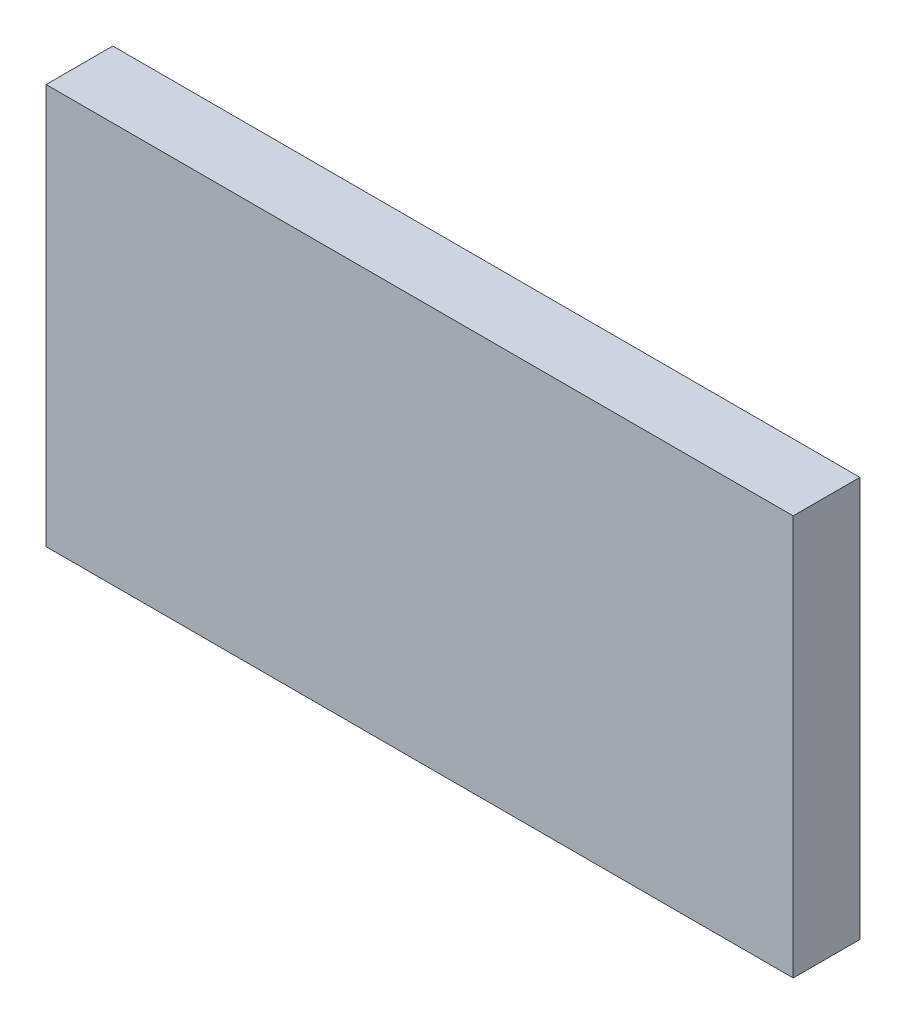
ISO-10303-21;
HEADER;
FILE_DESCRIPTION(('STEP AP214'),'2;1');
FILE_NAME('part.step','',(''),(''),'','','');
FILE_SCHEMA(('AUTOMOTIVE_DESIGN { 1 0 10303 214 1 1 1 1 }'));
ENDSEC;
DATA;
#1=APPLICATION_CONTEXT('core data for automotive mechanical design processes');
#2=APPLICATION_PROTOCOL_DEFINITION('international standard','automotive_design',2000,#1);
#3=PRODUCT_CONTEXT('',#1,'mechanical');
#4=PRODUCT('Part','Part','',(#3));
#5=PRODUCT_RELATED_PRODUCT_CATEGORY('part','',(#4));
#6=PRODUCT_DEFINITION_FORMATION('','',#4);
#7=PRODUCT_DEFINITION_CONTEXT('part definition',#1,'design');
#8=PRODUCT_DEFINITION('design','',#6,#7);
#9=PRODUCT_DEFINITION_SHAPE('','',#8);
#10=(LENGTH_UNIT() NAMED_UNIT(*) SI_UNIT(.MILLI.,.METRE.));
#11=(NAMED_UNIT(*) PLANE_ANGLE_UNIT() SI_UNIT($,.RADIAN.));
#12=(NAMED_UNIT(*) SI_UNIT($,.STERADIAN.) SOLID_ANGLE_UNIT());
#13=UNCERTAINTY_MEASURE_WITH_UNIT(LENGTH_MEASURE(1.E-05),#10,'distance_accuracy_value','');
#14=(GEOMETRIC_REPRESENTATION_CONTEXT(3) GLOBAL_UNCERTAINTY_ASSIGNED_CONTEXT((#13)) GLOBAL_UNIT_ASSIGNED_CONTEXT((#10,
#11,#12)) REPRESENTATION_CONTEXT('',''));
#15=CARTESIAN_POINT('',(0.,0.,0.));
#16=DIRECTION('',(0.,0.,1.));
#17=DIRECTION('',(1.,0.,0.));
#18=AXIS2_PLACEMENT_3D('',#15,#16,#17);
#19=CARTESIAN_POINT('',(0.864492466391478,-0.647007183565857,0.0826433070866142));
#20=DIRECTION('',(0.,0.,1.));
#21=DIRECTION('',(0.,-1.,0.));
#22=AXIS2_PLACEMENT_3D('',#19,#20,#21);
#23=PLANE('',#22);
#24=DIRECTION('',(0.,1.,0.));
#25=VECTOR('',#24,1.);
#26=CARTESIAN_POINT('',(0.790413726233998,-0.647007183565857,0.0826433070866142));
#27=LINE('',#26,#25);
#28=CARTESIAN_POINT('',(0.790413726233998,-0.64511741978633,0.0826433070866142));
#29=VERTEX_POINT('',#28);
#30=CARTESIAN_POINT('',(0.790413726233998,-0.607322144195778,0.0826433070866142));
#31=VERTEX_POINT('',#30);
#32=EDGE_CURVE('E71',#29,#31,#27,.T.);
#33=ORIENTED_EDGE('',*,*,#32,.T.);
#34=DIRECTION('',(1.,0.,0.));
#35=VECTOR('',#34,1.);
#36=CARTESIAN_POINT('',(0.864492466391478,-0.607322144195778,0.0826433070866142));
#37=LINE('',#36,#35);
#38=CARTESIAN_POINT('',(0.86096490733636,-0.607322144195778,0.0826433070866142));
#39=VERTEX_POINT('',#38);
#40=EDGE_CURVE('E54',#39,#31,#37,.F.);
#41=ORIENTED_EDGE('',*,*,#40,.F.);
#42=DIRECTION('',(0.,1.,0.));
#43=VECTOR('',#42,1.);
#44=CARTESIAN_POINT('',(0.86096490733636,-0.647007183565857,0.0826433070866142));
#45=LINE('',#44,#43);
#46=CARTESIAN_POINT('',(0.86096490733636,-0.64511741978633,0.0826433070866142));
#47=VERTEX_POINT('',#46);
#48=EDGE_CURVE('E20',#47,#39,#45,.T.);
#49=ORIENTED_EDGE('',*,*,#48,.F.);
#50=DIRECTION('',(1.,0.,0.));
#51=VECTOR('',#50,1.);
#52=CARTESIAN_POINT('',(0.78688616717888,-0.64511741978633,0.0826433070866142));
#53=LINE('',#52,#51);
#54=EDGE_CURVE('E81',#29,#47,#53,.T.);
#55=ORIENTED_EDGE('',*,*,#54,.F.);
#56=EDGE_LOOP('',(#33,#41,#49,#55));
#57=FACE_BOUND('',#56,.T.);
#58=ADVANCED_FACE('F17',(#57),#23,.F.);
#59=CARTESIAN_POINT('',(0.86096490733636,-0.647007183565857,0.0823283464566929));
#60=DIRECTION('',(-1.,0.,0.));
#61=DIRECTION('',(0.,0.,1.));
#62=AXIS2_PLACEMENT_3D('',#59,#60,#61);
#63=PLANE('',#62);
#64=DIRECTION('',(0.,0.,1.));
#65=VECTOR('',#64,1.);
#66=CARTESIAN_POINT('',(0.86096490733636,-0.64511741978633,0.0823283464566929));
#67=LINE('',#66,#65);
#68=CARTESIAN_POINT('',(0.86096490733636,-0.64511741978633,0.0889425196850394));
#69=VERTEX_POINT('',#68);
#70=EDGE_CURVE('E64',#47,#69,#67,.T.);
#71=ORIENTED_EDGE('',*,*,#70,.F.);
#72=ORIENTED_EDGE('',*,*,#48,.T.);
#73=DIRECTION('',(0.,0.,-1.));
#74=VECTOR('',#73,1.);
#75=CARTESIAN_POINT('',(0.86096490733636,-0.607322144195778,0.0823283464566929));
#76=LINE('',#75,#74);
#77=CARTESIAN_POINT('',(0.86096490733636,-0.607322144195778,0.0889425196850394));
#78=VERTEX_POINT('',#77);
#79=EDGE_CURVE('E62',#78,#39,#76,.T.);
#80=ORIENTED_EDGE('',*,*,#79,.F.);
#81=DIRECTION('',(0.,1.,0.));
#82=VECTOR('',#81,1.);
#83=CARTESIAN_POINT('',(0.86096490733636,-0.647007183565857,0.0889425196850394));
#84=LINE('',#83,#82);
#85=EDGE_CURVE('E83',#69,#78,#84,.T.);
#86=ORIENTED_EDGE('',*,*,#85,.F.);
#87=EDGE_LOOP('',(#71,#72,#80,#86));
#88=FACE_BOUND('',#87,.T.);
#89=ADVANCED_FACE('F60',(#88),#63,.F.);
#90=CARTESIAN_POINT('',(0.864492466391478,-0.607322144195778,0.0823283464566929));
#91=DIRECTION('',(0.,-1.,0.));
#92=DIRECTION('',(0.,0.,-1.));
#93=AXIS2_PLACEMENT_3D('',#90,#91,#92);
#94=PLANE('',#93);
#95=DIRECTION('',(0.,0.,1.));
#96=VECTOR('',#95,1.);
#97=CARTESIAN_POINT('',(0.790413726233998,-0.607322144195778,0.0823283464566929));
#98=LINE('',#97,#96);
#99=CARTESIAN_POINT('',(0.790413726233998,-0.607322144195778,0.0889425196850394));
#100=VERTEX_POINT('',#99);
#101=EDGE_CURVE('E73',#31,#100,#98,.T.);
#102=ORIENTED_EDGE('',*,*,#101,.T.);
#103=DIRECTION('',(1.,0.,0.));
#104=VECTOR('',#103,1.);
#105=CARTESIAN_POINT('',(0.864492466391478,-0.607322144195778,0.0889425196850394));
#106=LINE('',#105,#104);
#107=EDGE_CURVE('E69',#78,#100,#106,.F.);
#108=ORIENTED_EDGE('',*,*,#107,.F.);
#109=ORIENTED_EDGE('',*,*,#79,.T.);
#110=ORIENTED_EDGE('',*,*,#40,.T.);
#111=EDGE_LOOP('',(#102,#108,#109,#110));
#112=FACE_BOUND('',#111,.T.);
#113=ADVANCED_FACE('F68',(#112),#94,.F.);
#114=CARTESIAN_POINT('',(0.790413726233998,-0.647007183565857,0.0823283464566929));
#115=DIRECTION('',(-1.,0.,0.));
#116=DIRECTION('',(0.,0.,1.));
#117=AXIS2_PLACEMENT_3D('',#114,#115,#116);
#118=PLANE('',#117);
#119=ORIENTED_EDGE('',*,*,#32,.F.);
#120=DIRECTION('',(0.,0.,1.));
#121=VECTOR('',#120,1.);
#122=CARTESIAN_POINT('',(0.790413726233998,-0.64511741978633,0.0823283464566929));
#123=LINE('',#122,#121);
#124=CARTESIAN_POINT('',(0.790413726233998,-0.64511741978633,0.0889425196850394));
#125=VERTEX_POINT('',#124);
#126=EDGE_CURVE('E78',#125,#29,#123,.F.);
#127=ORIENTED_EDGE('',*,*,#126,.F.);
#128=DIRECTION('',(0.,1.,0.));
#129=VECTOR('',#128,1.);
#130=CARTESIAN_POINT('',(0.790413726233998,-0.647007183565857,0.0889425196850394));
#131=LINE('',#130,#129);
#132=EDGE_CURVE('E26',#100,#125,#131,.F.);
#133=ORIENTED_EDGE('',*,*,#132,.F.);
#134=ORIENTED_EDGE('',*,*,#101,.F.);
#135=EDGE_LOOP('',(#119,#127,#133,#134));
#136=FACE_BOUND('',#135,.T.);
#137=ADVANCED_FACE('F88',(#136),#118,.T.);
#138=CARTESIAN_POINT('',(0.78688616717888,-0.64511741978633,0.0823283464566929));
#139=DIRECTION('',(0.,1.,0.));
#140=DIRECTION('',(0.,0.,1.));
#141=AXIS2_PLACEMENT_3D('',#138,#139,#140);
#142=PLANE('',#141);
#143=ORIENTED_EDGE('',*,*,#126,.T.);
#144=ORIENTED_EDGE('',*,*,#54,.T.);
#145=ORIENTED_EDGE('',*,*,#70,.T.);
#146=DIRECTION('',(1.,0.,0.));
#147=VECTOR('',#146,1.);
#148=CARTESIAN_POINT('',(0.864492466391478,-0.64511741978633,0.0889425196850394));
#149=LINE('',#148,#147);
#150=EDGE_CURVE('E11',#125,#69,#149,.T.);
#151=ORIENTED_EDGE('',*,*,#150,.F.);
#152=EDGE_LOOP('',(#143,#144,#145,#151));
#153=FACE_BOUND('',#152,.T.);
#154=ADVANCED_FACE('F91',(#153),#142,.F.);
#155=CARTESIAN_POINT('',(0.864492466391478,-0.647007183565857,0.0889425196850394));
#156=DIRECTION('',(0.,0.,-1.));
#157=DIRECTION('',(0.,1.,0.));
#158=AXIS2_PLACEMENT_3D('',#155,#156,#157);
#159=PLANE('',#158);
#160=ORIENTED_EDGE('',*,*,#132,.T.);
#161=ORIENTED_EDGE('',*,*,#150,.T.);
#162=ORIENTED_EDGE('',*,*,#85,.T.);
#163=ORIENTED_EDGE('',*,*,#107,.T.);
#164=EDGE_LOOP('',(#160,#161,#162,#163));
#165=FACE_BOUND('',#164,.T.);
#166=ADVANCED_FACE('F86',(#165),#159,.F.);
#167=CLOSED_SHELL('',(#58,#89,#113,#137,#154,#166));
#168=MANIFOLD_SOLID_BREP('B1',#167);
#169=ADVANCED_BREP_SHAPE_REPRESENTATION('',(#18,#168),#14);
#170=SHAPE_DEFINITION_REPRESENTATION(#9,#169);
ENDSEC;
END-ISO-10303-21;
